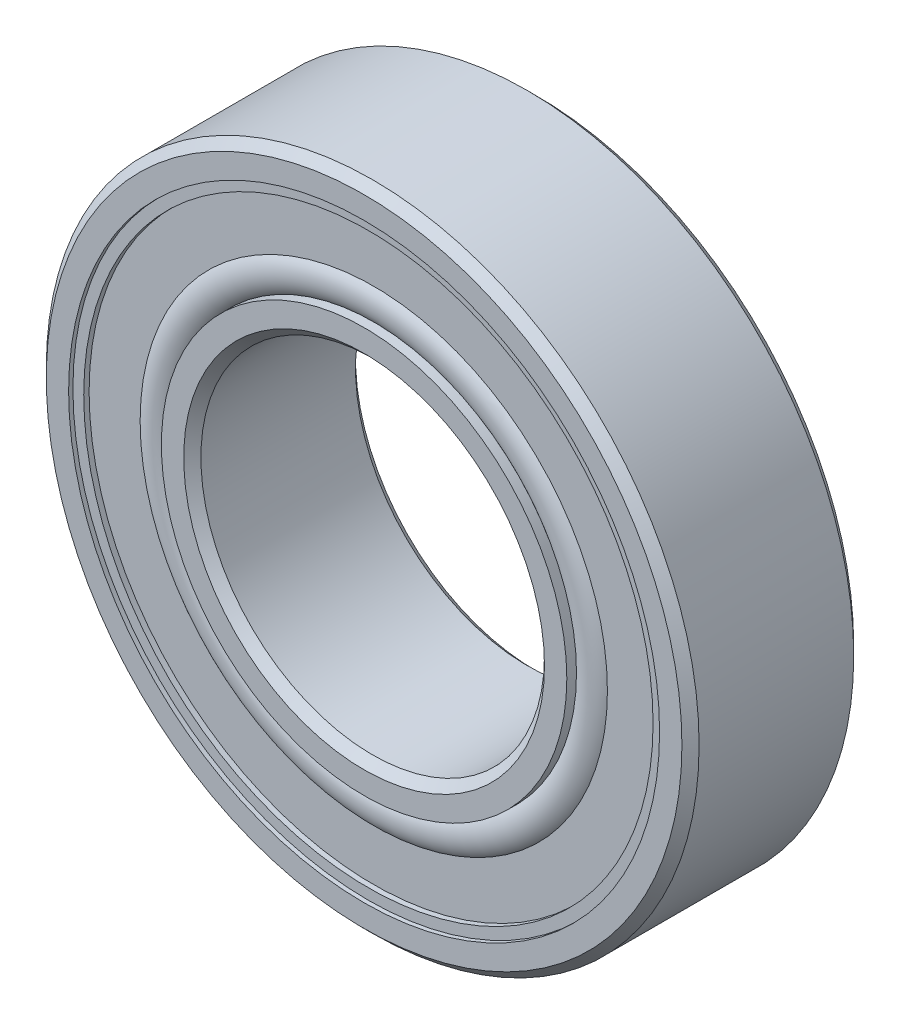
ISO-10303-21;
HEADER;
FILE_DESCRIPTION(('STEP AP214'),'2;1');
FILE_NAME('part.step','',(''),(''),'','','');
FILE_SCHEMA(('AUTOMOTIVE_DESIGN { 1 0 10303 214 1 1 1 1 }'));
ENDSEC;
DATA;
#1=APPLICATION_CONTEXT('core data for automotive mechanical design processes');
#2=APPLICATION_PROTOCOL_DEFINITION('international standard','automotive_design',2000,#1);
#3=PRODUCT_CONTEXT('',#1,'mechanical');
#4=PRODUCT('Part','Part','',(#3));
#5=PRODUCT_RELATED_PRODUCT_CATEGORY('part','',(#4));
#6=PRODUCT_DEFINITION_FORMATION('','',#4);
#7=PRODUCT_DEFINITION_CONTEXT('part definition',#1,'design');
#8=PRODUCT_DEFINITION('design','',#6,#7);
#9=PRODUCT_DEFINITION_SHAPE('','',#8);
#10=(LENGTH_UNIT() NAMED_UNIT(*) SI_UNIT(.MILLI.,.METRE.));
#11=(NAMED_UNIT(*) PLANE_ANGLE_UNIT() SI_UNIT($,.RADIAN.));
#12=(NAMED_UNIT(*) SI_UNIT($,.STERADIAN.) SOLID_ANGLE_UNIT());
#13=UNCERTAINTY_MEASURE_WITH_UNIT(LENGTH_MEASURE(1.E-05),#10,'distance_accuracy_value','');
#14=(GEOMETRIC_REPRESENTATION_CONTEXT(3) GLOBAL_UNCERTAINTY_ASSIGNED_CONTEXT((#13)) GLOBAL_UNIT_ASSIGNED_CONTEXT((#10,
#11,#12)) REPRESENTATION_CONTEXT('',''));
#15=CARTESIAN_POINT('',(0.,0.,0.));
#16=DIRECTION('',(0.,0.,1.));
#17=DIRECTION('',(1.,0.,0.));
#18=AXIS2_PLACEMENT_3D('',#15,#16,#17);
#19=CARTESIAN_POINT('',(0.,0.,-1.65028677787898));
#20=DIRECTION('',(0.,0.,1.));
#21=DIRECTION('',(1.,0.,0.));
#22=AXIS2_PLACEMENT_3D('',#19,#20,#21);
#23=TOROIDAL_SURFACE('',#22,6.35000000000001,0.724713222121017);
#24=CARTESIAN_POINT('',(0.,0.,-2.21836182073602));
#25=DIRECTION('',(0.,0.,1.));
#26=DIRECTION('',(1.,0.,0.));
#27=AXIS2_PLACEMENT_3D('',#24,#25,#26);
#28=CIRCLE('',#27,6.80000000000001);
#29=CARTESIAN_POINT('',(6.80000000000001,0.,-2.21836182073602));
#30=VERTEX_POINT('',#29);
#31=EDGE_CURVE('E11',#30,#30,#28,.T.);
#32=ORIENTED_EDGE('',*,*,#31,.F.);
#33=EDGE_LOOP('',(#32));
#34=FACE_BOUND('',#33,.T.);
#35=CARTESIAN_POINT('',(0.,0.,-2.21836182073602));
#36=DIRECTION('',(0.,0.,1.));
#37=DIRECTION('',(1.,0.,0.));
#38=AXIS2_PLACEMENT_3D('',#35,#36,#37);
#39=CIRCLE('',#38,5.90000000000001);
#40=CARTESIAN_POINT('',(5.90000000000001,0.,-2.21836182073602));
#41=VERTEX_POINT('',#40);
#42=EDGE_CURVE('E73',#41,#41,#39,.T.);
#43=ORIENTED_EDGE('',*,*,#42,.T.);
#44=EDGE_LOOP('',(#43));
#45=FACE_BOUND('',#44,.T.);
#46=ADVANCED_FACE('F48',(#34,#45),#23,.T.);
#47=CARTESIAN_POINT('',(0.,8.28499999999999,-2.21836182073602));
#48=DIRECTION('',(0.,0.,1.));
#49=DIRECTION('',(1.,0.,0.));
#50=AXIS2_PLACEMENT_3D('',#47,#48,#49);
#51=PLANE('',#50);
#52=CARTESIAN_POINT('',(0.,0.,-2.21836182073602));
#53=DIRECTION('',(0.,0.,1.));
#54=DIRECTION('',(1.,0.,0.));
#55=AXIS2_PLACEMENT_3D('',#52,#53,#54);
#56=CIRCLE('',#55,8.28499999999999);
#57=CARTESIAN_POINT('',(8.28499999999999,0.,-2.21836182073602));
#58=VERTEX_POINT('',#57);
#59=EDGE_CURVE('E54',#58,#58,#56,.T.);
#60=ORIENTED_EDGE('',*,*,#59,.F.);
#61=EDGE_LOOP('',(#60));
#62=FACE_BOUND('',#61,.T.);
#63=ORIENTED_EDGE('',*,*,#31,.T.);
#64=EDGE_LOOP('',(#63));
#65=FACE_BOUND('',#64,.T.);
#66=ADVANCED_FACE('F104',(#62,#65),#51,.F.);
#67=CARTESIAN_POINT('',(0.,0.,2.5));
#68=DIRECTION('',(0.,0.,1.));
#69=DIRECTION('',(1.,0.,0.));
#70=AXIS2_PLACEMENT_3D('',#67,#68,#69);
#71=CYLINDRICAL_SURFACE('',#70,8.28499999999999);
#72=CARTESIAN_POINT('',(0.,0.,-2.375));
#73=DIRECTION('',(0.,0.,1.));
#74=DIRECTION('',(1.,0.,0.));
#75=AXIS2_PLACEMENT_3D('',#72,#73,#74);
#76=CIRCLE('',#75,8.28499999999999);
#77=CARTESIAN_POINT('',(8.28499999999999,0.,-2.375));
#78=VERTEX_POINT('',#77);
#79=EDGE_CURVE('E58',#78,#78,#76,.T.);
#80=ORIENTED_EDGE('',*,*,#79,.F.);
#81=EDGE_LOOP('',(#80));
#82=FACE_BOUND('',#81,.T.);
#83=ORIENTED_EDGE('',*,*,#59,.T.);
#84=EDGE_LOOP('',(#83));
#85=FACE_BOUND('',#84,.T.);
#86=ADVANCED_FACE('F99',(#82,#85),#71,.F.);
#87=CARTESIAN_POINT('',(0.,8.59999999999999,-2.375));
#88=DIRECTION('',(0.,0.,1.));
#89=DIRECTION('',(1.,0.,0.));
#90=AXIS2_PLACEMENT_3D('',#87,#88,#89);
#91=PLANE('',#90);
#92=CARTESIAN_POINT('',(0.,0.,-2.375));
#93=DIRECTION('',(0.,0.,1.));
#94=DIRECTION('',(1.,0.,0.));
#95=AXIS2_PLACEMENT_3D('',#92,#93,#94);
#96=CIRCLE('',#95,8.59999999999999);
#97=CARTESIAN_POINT('',(8.59999999999999,0.,-2.375));
#98=VERTEX_POINT('',#97);
#99=EDGE_CURVE('E62',#98,#98,#96,.T.);
#100=ORIENTED_EDGE('',*,*,#99,.F.);
#101=EDGE_LOOP('',(#100));
#102=FACE_BOUND('',#101,.T.);
#103=ORIENTED_EDGE('',*,*,#79,.T.);
#104=EDGE_LOOP('',(#103));
#105=FACE_BOUND('',#104,.T.);
#106=ADVANCED_FACE('F93',(#102,#105),#91,.F.);
#107=CARTESIAN_POINT('',(0.,0.,2.5));
#108=DIRECTION('',(0.,0.,1.));
#109=DIRECTION('',(1.,0.,0.));
#110=AXIS2_PLACEMENT_3D('',#107,#108,#109);
#111=CYLINDRICAL_SURFACE('',#110,8.59999999999999);
#112=CARTESIAN_POINT('',(0.,0.,-1.74844728294409));
#113=DIRECTION('',(0.,0.,1.));
#114=DIRECTION('',(1.,0.,0.));
#115=AXIS2_PLACEMENT_3D('',#112,#113,#114);
#116=CIRCLE('',#115,8.59999999999999);
#117=CARTESIAN_POINT('',(8.59999999999999,0.,-1.74844728294409));
#118=VERTEX_POINT('',#117);
#119=EDGE_CURVE('E67',#118,#118,#116,.T.);
#120=ORIENTED_EDGE('',*,*,#119,.F.);
#121=EDGE_LOOP('',(#120));
#122=FACE_BOUND('',#121,.T.);
#123=ORIENTED_EDGE('',*,*,#99,.T.);
#124=EDGE_LOOP('',(#123));
#125=FACE_BOUND('',#124,.T.);
#126=ADVANCED_FACE('F87',(#122,#125),#111,.T.);
#127=CARTESIAN_POINT('',(0.,8.59999999999999,-1.74844728294409));
#128=DIRECTION('',(0.,0.,-1.));
#129=DIRECTION('',(-1.,0.,0.));
#130=AXIS2_PLACEMENT_3D('',#127,#128,#129);
#131=PLANE('',#130);
#132=CARTESIAN_POINT('',(0.,0.,-1.74844728294409));
#133=DIRECTION('',(0.,0.,1.));
#134=DIRECTION('',(1.,0.,0.));
#135=AXIS2_PLACEMENT_3D('',#132,#133,#134);
#136=CIRCLE('',#135,5.90000000000001);
#137=CARTESIAN_POINT('',(5.90000000000001,0.,-1.74844728294409));
#138=VERTEX_POINT('',#137);
#139=EDGE_CURVE('E70',#138,#138,#136,.T.);
#140=ORIENTED_EDGE('',*,*,#139,.F.);
#141=EDGE_LOOP('',(#140));
#142=FACE_BOUND('',#141,.T.);
#143=ORIENTED_EDGE('',*,*,#119,.T.);
#144=EDGE_LOOP('',(#143));
#145=FACE_BOUND('',#144,.T.);
#146=ADVANCED_FACE('F81',(#142,#145),#131,.F.);
#147=CARTESIAN_POINT('',(0.,0.,2.5));
#148=DIRECTION('',(0.,0.,1.));
#149=DIRECTION('',(1.,0.,0.));
#150=AXIS2_PLACEMENT_3D('',#147,#148,#149);
#151=CYLINDRICAL_SURFACE('',#150,5.90000000000001);
#152=ORIENTED_EDGE('',*,*,#42,.F.);
#153=EDGE_LOOP('',(#152));
#154=FACE_BOUND('',#153,.T.);
#155=ORIENTED_EDGE('',*,*,#139,.T.);
#156=EDGE_LOOP('',(#155));
#157=FACE_BOUND('',#156,.T.);
#158=ADVANCED_FACE('F78',(#154,#157),#151,.F.);
#159=CLOSED_SHELL('',(#46,#66,#86,#106,#126,#146,#158));
#160=MANIFOLD_SOLID_BREP('B2',#159);
#161=CARTESIAN_POINT('',(0.,8.59999999999999,2.375));
#162=DIRECTION('',(0.,0.,-1.));
#163=DIRECTION('',(-1.,0.,0.));
#164=AXIS2_PLACEMENT_3D('',#161,#162,#163);
#165=PLANE('',#164);
#166=CARTESIAN_POINT('',(0.,0.,2.375));
#167=DIRECTION('',(0.,0.,1.));
#168=DIRECTION('',(1.,0.,0.));
#169=AXIS2_PLACEMENT_3D('',#166,#167,#168);
#170=CIRCLE('',#169,8.28499999999999);
#171=CARTESIAN_POINT('',(8.28499999999999,0.,2.375));
#172=VERTEX_POINT('',#171);
#173=EDGE_CURVE('E172',#172,#172,#170,.T.);
#174=ORIENTED_EDGE('',*,*,#173,.F.);
#175=EDGE_LOOP('',(#174));
#176=FACE_BOUND('',#175,.T.);
#177=CARTESIAN_POINT('',(0.,0.,2.375));
#178=DIRECTION('',(0.,0.,1.));
#179=DIRECTION('',(1.,0.,0.));
#180=AXIS2_PLACEMENT_3D('',#177,#178,#179);
#181=CIRCLE('',#180,8.59999999999999);
#182=CARTESIAN_POINT('',(8.59999999999999,0.,2.375));
#183=VERTEX_POINT('',#182);
#184=EDGE_CURVE('E47',#183,#183,#181,.T.);
#185=ORIENTED_EDGE('',*,*,#184,.T.);
#186=EDGE_LOOP('',(#185));
#187=FACE_BOUND('',#186,.T.);
#188=ADVANCED_FACE('F147',(#176,#187),#165,.F.);
#189=CARTESIAN_POINT('',(0.,0.,2.5));
#190=DIRECTION('',(0.,0.,1.));
#191=DIRECTION('',(1.,0.,0.));
#192=AXIS2_PLACEMENT_3D('',#189,#190,#191);
#193=CYLINDRICAL_SURFACE('',#192,8.59999999999999);
#194=ORIENTED_EDGE('',*,*,#184,.F.);
#195=EDGE_LOOP('',(#194));
#196=FACE_BOUND('',#195,.T.);
#197=CARTESIAN_POINT('',(0.,0.,1.74844728294409));
#198=DIRECTION('',(0.,0.,1.));
#199=DIRECTION('',(1.,0.,0.));
#200=AXIS2_PLACEMENT_3D('',#197,#198,#199);
#201=CIRCLE('',#200,8.59999999999999);
#202=CARTESIAN_POINT('',(8.59999999999999,0.,1.74844728294409));
#203=VERTEX_POINT('',#202);
#204=EDGE_CURVE('E153',#203,#203,#201,.T.);
#205=ORIENTED_EDGE('',*,*,#204,.T.);
#206=EDGE_LOOP('',(#205));
#207=FACE_BOUND('',#206,.T.);
#208=ADVANCED_FACE('F179',(#196,#207),#193,.T.);
#209=CARTESIAN_POINT('',(0.,8.59999999999999,1.74844728294409));
#210=DIRECTION('',(0.,0.,1.));
#211=DIRECTION('',(1.,0.,0.));
#212=AXIS2_PLACEMENT_3D('',#209,#210,#211);
#213=PLANE('',#212);
#214=ORIENTED_EDGE('',*,*,#204,.F.);
#215=EDGE_LOOP('',(#214));
#216=FACE_BOUND('',#215,.T.);
#217=CARTESIAN_POINT('',(0.,0.,1.74844728294409));
#218=DIRECTION('',(0.,0.,1.));
#219=DIRECTION('',(1.,0.,0.));
#220=AXIS2_PLACEMENT_3D('',#217,#218,#219);
#221=CIRCLE('',#220,5.90000000000001);
#222=CARTESIAN_POINT('',(5.90000000000001,0.,1.74844728294409));
#223=VERTEX_POINT('',#222);
#224=EDGE_CURVE('E157',#223,#223,#221,.T.);
#225=ORIENTED_EDGE('',*,*,#224,.T.);
#226=EDGE_LOOP('',(#225));
#227=FACE_BOUND('',#226,.T.);
#228=ADVANCED_FACE('F183',(#216,#227),#213,.F.);
#229=CARTESIAN_POINT('',(0.,0.,2.5));
#230=DIRECTION('',(0.,0.,1.));
#231=DIRECTION('',(1.,0.,0.));
#232=AXIS2_PLACEMENT_3D('',#229,#230,#231);
#233=CYLINDRICAL_SURFACE('',#232,5.90000000000001);
#234=ORIENTED_EDGE('',*,*,#224,.F.);
#235=EDGE_LOOP('',(#234));
#236=FACE_BOUND('',#235,.T.);
#237=CARTESIAN_POINT('',(0.,0.,2.21836182073602));
#238=DIRECTION('',(0.,0.,1.));
#239=DIRECTION('',(1.,0.,0.));
#240=AXIS2_PLACEMENT_3D('',#237,#238,#239);
#241=CIRCLE('',#240,5.90000000000001);
#242=CARTESIAN_POINT('',(5.90000000000001,0.,2.21836182073602));
#243=VERTEX_POINT('',#242);
#244=EDGE_CURVE('E161',#243,#243,#241,.T.);
#245=ORIENTED_EDGE('',*,*,#244,.T.);
#246=EDGE_LOOP('',(#245));
#247=FACE_BOUND('',#246,.T.);
#248=ADVANCED_FACE('F188',(#236,#247),#233,.F.);
#249=CARTESIAN_POINT('',(0.,0.,1.65028677787898));
#250=DIRECTION('',(0.,0.,1.));
#251=DIRECTION('',(1.,0.,0.));
#252=AXIS2_PLACEMENT_3D('',#249,#250,#251);
#253=TOROIDAL_SURFACE('',#252,6.35000000000001,0.724713222121017);
#254=ORIENTED_EDGE('',*,*,#244,.F.);
#255=EDGE_LOOP('',(#254));
#256=FACE_BOUND('',#255,.T.);
#257=CARTESIAN_POINT('',(0.,0.,2.21836182073602));
#258=DIRECTION('',(0.,0.,1.));
#259=DIRECTION('',(1.,0.,0.));
#260=AXIS2_PLACEMENT_3D('',#257,#258,#259);
#261=CIRCLE('',#260,6.80000000000001);
#262=CARTESIAN_POINT('',(6.80000000000001,0.,2.21836182073602));
#263=VERTEX_POINT('',#262);
#264=EDGE_CURVE('E166',#263,#263,#261,.T.);
#265=ORIENTED_EDGE('',*,*,#264,.T.);
#266=EDGE_LOOP('',(#265));
#267=FACE_BOUND('',#266,.T.);
#268=ADVANCED_FACE('F194',(#256,#267),#253,.T.);
#269=CARTESIAN_POINT('',(0.,8.28499999999999,2.21836182073602));
#270=DIRECTION('',(0.,0.,-1.));
#271=DIRECTION('',(-1.,0.,0.));
#272=AXIS2_PLACEMENT_3D('',#269,#270,#271);
#273=PLANE('',#272);
#274=ORIENTED_EDGE('',*,*,#264,.F.);
#275=EDGE_LOOP('',(#274));
#276=FACE_BOUND('',#275,.T.);
#277=CARTESIAN_POINT('',(0.,0.,2.21836182073602));
#278=DIRECTION('',(0.,0.,1.));
#279=DIRECTION('',(1.,0.,0.));
#280=AXIS2_PLACEMENT_3D('',#277,#278,#279);
#281=CIRCLE('',#280,8.28499999999999);
#282=CARTESIAN_POINT('',(8.28499999999999,0.,2.21836182073602));
#283=VERTEX_POINT('',#282);
#284=EDGE_CURVE('E169',#283,#283,#281,.T.);
#285=ORIENTED_EDGE('',*,*,#284,.T.);
#286=EDGE_LOOP('',(#285));
#287=FACE_BOUND('',#286,.T.);
#288=ADVANCED_FACE('F198',(#276,#287),#273,.F.);
#289=CARTESIAN_POINT('',(0.,0.,2.5));
#290=DIRECTION('',(0.,0.,1.));
#291=DIRECTION('',(1.,0.,0.));
#292=AXIS2_PLACEMENT_3D('',#289,#290,#291);
#293=CYLINDRICAL_SURFACE('',#292,8.28499999999999);
#294=ORIENTED_EDGE('',*,*,#284,.F.);
#295=EDGE_LOOP('',(#294));
#296=FACE_BOUND('',#295,.T.);
#297=ORIENTED_EDGE('',*,*,#173,.T.);
#298=EDGE_LOOP('',(#297));
#299=FACE_BOUND('',#298,.T.);
#300=ADVANCED_FACE('F176',(#296,#299),#293,.F.);
#301=CLOSED_SHELL('',(#188,#208,#228,#248,#268,#288,#300));
#302=MANIFOLD_SOLID_BREP('B6',#301);
#303=CARTESIAN_POINT('',(-4.66021017022734,5.55382221261265,0.));
#304=DIRECTION('',(0.,0.,1.));
#305=DIRECTION('',(-0.64278760968653,0.766044443118986,0.));
#306=AXIS2_PLACEMENT_3D('',#303,#304,#305);
#307=SPHERICAL_SURFACE('',#306,1.74844728294409);
#308=CARTESIAN_POINT('',(-4.66021017022734,5.55382221261265,1.74844728294409));
#309=VERTEX_POINT('',#308);
#310=VERTEX_LOOP('',#309);
#311=FACE_BOUND('',#310,.T.);
#312=ADVANCED_FACE('F246',(#311),#307,.T.);
#313=CLOSED_SHELL('',(#312));
#314=MANIFOLD_SOLID_BREP('B42',#313);
#315=CARTESIAN_POINT('',(-7.13985620933849,1.25894928808532,0.));
#316=DIRECTION('',(0.,0.,1.));
#317=DIRECTION('',(-0.984807753012206,0.17364817766694,0.));
#318=AXIS2_PLACEMENT_3D('',#315,#316,#317);
#319=SPHERICAL_SURFACE('',#318,1.74844728294409);
#320=CARTESIAN_POINT('',(-7.13985620933849,1.25894928808532,1.74844728294409));
#321=VERTEX_POINT('',#320);
#322=VERTEX_LOOP('',#321);
#323=FACE_BOUND('',#322,.T.);
#324=ADVANCED_FACE('F265',(#323),#319,.T.);
#325=CLOSED_SHELL('',(#324));
#326=MANIFOLD_SOLID_BREP('B143',#325);
#327=CARTESIAN_POINT('',(-6.27868417743721,-3.62499999999994,0.));
#328=DIRECTION('',(0.,0.,1.));
#329=DIRECTION('',(-0.866025403784443,-0.499999999999992,0.));
#330=AXIS2_PLACEMENT_3D('',#327,#328,#329);
#331=SPHERICAL_SURFACE('',#330,1.74844728294409);
#332=CARTESIAN_POINT('',(-6.27868417743721,-3.62499999999994,1.74844728294409));
#333=VERTEX_POINT('',#332);
#334=VERTEX_LOOP('',#333);
#335=FACE_BOUND('',#334,.T.);
#336=ADVANCED_FACE('F284',(#335),#331,.T.);
#337=CLOSED_SHELL('',(#336));
#338=MANIFOLD_SOLID_BREP('B242',#337);
#339=CARTESIAN_POINT('',(-2.47964603911115,-6.81277150069782,0.));
#340=DIRECTION('',(0.,0.,1.));
#341=DIRECTION('',(-0.342020143325676,-0.939692620785906,0.));
#342=AXIS2_PLACEMENT_3D('',#339,#340,#341);
#343=SPHERICAL_SURFACE('',#342,1.74844728294409);
#344=CARTESIAN_POINT('',(-2.47964603911115,-6.81277150069782,1.74844728294409));
#345=VERTEX_POINT('',#344);
#346=VERTEX_LOOP('',#345);
#347=FACE_BOUND('',#346,.T.);
#348=ADVANCED_FACE('F303',(#347),#343,.T.);
#349=CLOSED_SHELL('',(#348));
#350=MANIFOLD_SOLID_BREP('B261',#349);
#351=CARTESIAN_POINT('',(2.47964603911106,-6.81277150069785,0.));
#352=DIRECTION('',(0.,0.,1.));
#353=DIRECTION('',(0.342020143325663,-0.939692620785911,0.));
#354=AXIS2_PLACEMENT_3D('',#351,#352,#353);
#355=SPHERICAL_SURFACE('',#354,1.74844728294409);
#356=CARTESIAN_POINT('',(2.47964603911106,-6.81277150069785,1.74844728294409));
#357=VERTEX_POINT('',#356);
#358=VERTEX_LOOP('',#357);
#359=FACE_BOUND('',#358,.T.);
#360=ADVANCED_FACE('F322',(#359),#355,.T.);
#361=CLOSED_SHELL('',(#360));
#362=MANIFOLD_SOLID_BREP('B280',#361);
#363=CARTESIAN_POINT('',(6.27868417743716,-3.62500000000003,0.));
#364=DIRECTION('',(0.,0.,1.));
#365=DIRECTION('',(0.866025403784436,-0.500000000000004,0.));
#366=AXIS2_PLACEMENT_3D('',#363,#364,#365);
#367=SPHERICAL_SURFACE('',#366,1.74844728294409);
#368=CARTESIAN_POINT('',(6.27868417743716,-3.62500000000003,1.74844728294409));
#369=VERTEX_POINT('',#368);
#370=VERTEX_LOOP('',#369);
#371=FACE_BOUND('',#370,.T.);
#372=ADVANCED_FACE('F341',(#371),#367,.T.);
#373=CLOSED_SHELL('',(#372));
#374=MANIFOLD_SOLID_BREP('B299',#373);
#375=CARTESIAN_POINT('',(7.13985620933851,1.25894928808522,0.));
#376=DIRECTION('',(0.,0.,1.));
#377=DIRECTION('',(0.984807753012209,0.173648177666927,0.));
#378=AXIS2_PLACEMENT_3D('',#375,#376,#377);
#379=SPHERICAL_SURFACE('',#378,1.74844728294409);
#380=CARTESIAN_POINT('',(7.13985620933851,1.25894928808522,1.74844728294409));
#381=VERTEX_POINT('',#380);
#382=VERTEX_LOOP('',#381);
#383=FACE_BOUND('',#382,.T.);
#384=ADVANCED_FACE('F360',(#383),#379,.T.);
#385=CLOSED_SHELL('',(#384));
#386=MANIFOLD_SOLID_BREP('B318',#385);
#387=CARTESIAN_POINT('',(4.66021017022742,5.55382221261258,0.));
#388=DIRECTION('',(0.,0.,1.));
#389=DIRECTION('',(0.642787609686541,0.766044443118977,0.));
#390=AXIS2_PLACEMENT_3D('',#387,#388,#389);
#391=SPHERICAL_SURFACE('',#390,1.74844728294409);
#392=CARTESIAN_POINT('',(4.66021017022742,5.55382221261258,1.74844728294409));
#393=VERTEX_POINT('',#392);
#394=VERTEX_LOOP('',#393);
#395=FACE_BOUND('',#394,.T.);
#396=ADVANCED_FACE('F379',(#395),#391,.T.);
#397=CLOSED_SHELL('',(#396));
#398=MANIFOLD_SOLID_BREP('B337',#397);
#399=CARTESIAN_POINT('',(0.,7.25,0.));
#400=DIRECTION('',(0.,0.,1.));
#401=DIRECTION('',(0.,1.,0.));
#402=AXIS2_PLACEMENT_3D('',#399,#400,#401);
#403=SPHERICAL_SURFACE('',#402,1.74844728294409);
#404=CARTESIAN_POINT('',(0.,7.25,1.74844728294409));
#405=VERTEX_POINT('',#404);
#406=VERTEX_LOOP('',#405);
#407=FACE_BOUND('',#406,.T.);
#408=ADVANCED_FACE('F400',(#407),#403,.T.);
#409=CLOSED_SHELL('',(#408));
#410=MANIFOLD_SOLID_BREP('B356',#409);
#411=CARTESIAN_POINT('',(0.,0.,2.5));
#412=DIRECTION('',(0.,0.,1.));
#413=DIRECTION('',(1.,0.,0.));
#414=AXIS2_PLACEMENT_3D('',#411,#412,#413);
#415=CONICAL_SURFACE('',#414,5.25,0.785398163397443);
#416=CARTESIAN_POINT('',(0.,0.,2.25));
#417=DIRECTION('',(0.,0.,1.));
#418=DIRECTION('',(1.,0.,0.));
#419=AXIS2_PLACEMENT_3D('',#416,#417,#418);
#420=CIRCLE('',#419,5.);
#421=CARTESIAN_POINT('',(5.,0.,2.25));
#422=VERTEX_POINT('',#421);
#423=EDGE_CURVE('E399',#422,#422,#420,.T.);
#424=ORIENTED_EDGE('',*,*,#423,.F.);
#425=EDGE_LOOP('',(#424));
#426=FACE_BOUND('',#425,.T.);
#427=CARTESIAN_POINT('',(0.,0.,2.5));
#428=DIRECTION('',(0.,0.,1.));
#429=DIRECTION('',(1.,0.,0.));
#430=AXIS2_PLACEMENT_3D('',#427,#428,#429);
#431=CIRCLE('',#430,5.25);
#432=CARTESIAN_POINT('',(5.25,0.,2.5));
#433=VERTEX_POINT('',#432);
#434=EDGE_CURVE('E446',#433,#433,#431,.T.);
#435=ORIENTED_EDGE('',*,*,#434,.T.);
#436=EDGE_LOOP('',(#435));
#437=FACE_BOUND('',#436,.T.);
#438=ADVANCED_FACE('F418',(#426,#437),#415,.F.);
#439=CARTESIAN_POINT('',(0.,0.,2.5));
#440=DIRECTION('',(0.,0.,1.));
#441=DIRECTION('',(1.,0.,0.));
#442=AXIS2_PLACEMENT_3D('',#439,#440,#441);
#443=CYLINDRICAL_SURFACE('',#442,5.);
#444=CARTESIAN_POINT('',(0.,0.,-2.25));
#445=DIRECTION('',(0.,0.,1.));
#446=DIRECTION('',(1.,0.,0.));
#447=AXIS2_PLACEMENT_3D('',#444,#445,#446);
#448=CIRCLE('',#447,5.);
#449=CARTESIAN_POINT('',(5.,0.,-2.25));
#450=VERTEX_POINT('',#449);
#451=EDGE_CURVE('E424',#450,#450,#448,.T.);
#452=ORIENTED_EDGE('',*,*,#451,.F.);
#453=EDGE_LOOP('',(#452));
#454=FACE_BOUND('',#453,.T.);
#455=ORIENTED_EDGE('',*,*,#423,.T.);
#456=EDGE_LOOP('',(#455));
#457=FACE_BOUND('',#456,.T.);
#458=ADVANCED_FACE('F483',(#454,#457),#443,.F.);
#459=CARTESIAN_POINT('',(0.,0.,-2.25));
#460=DIRECTION('',(0.,0.,-1.));
#461=DIRECTION('',(-1.,0.,0.));
#462=AXIS2_PLACEMENT_3D('',#459,#460,#461);
#463=CONICAL_SURFACE('',#462,5.,0.785398163397438);
#464=CARTESIAN_POINT('',(0.,0.,-2.5));
#465=DIRECTION('',(0.,0.,1.));
#466=DIRECTION('',(1.,0.,0.));
#467=AXIS2_PLACEMENT_3D('',#464,#465,#466);
#468=CIRCLE('',#467,5.25);
#469=CARTESIAN_POINT('',(5.25,0.,-2.5));
#470=VERTEX_POINT('',#469);
#471=EDGE_CURVE('E428',#470,#470,#468,.T.);
#472=ORIENTED_EDGE('',*,*,#471,.F.);
#473=EDGE_LOOP('',(#472));
#474=FACE_BOUND('',#473,.T.);
#475=ORIENTED_EDGE('',*,*,#451,.T.);
#476=EDGE_LOOP('',(#475));
#477=FACE_BOUND('',#476,.T.);
#478=ADVANCED_FACE('F478',(#474,#477),#463,.F.);
#479=CARTESIAN_POINT('',(0.,5.25,-2.5));
#480=DIRECTION('',(0.,0.,1.));
#481=DIRECTION('',(1.,0.,0.));
#482=AXIS2_PLACEMENT_3D('',#479,#480,#481);
#483=PLANE('',#482);
#484=CARTESIAN_POINT('',(0.,0.,-2.5));
#485=DIRECTION('',(0.,0.,1.));
#486=DIRECTION('',(1.,0.,0.));
#487=AXIS2_PLACEMENT_3D('',#484,#485,#486);
#488=CIRCLE('',#487,5.90000000000001);
#489=CARTESIAN_POINT('',(5.90000000000001,0.,-2.5));
#490=VERTEX_POINT('',#489);
#491=EDGE_CURVE('E432',#490,#490,#488,.T.);
#492=ORIENTED_EDGE('',*,*,#491,.F.);
#493=EDGE_LOOP('',(#492));
#494=FACE_BOUND('',#493,.T.);
#495=ORIENTED_EDGE('',*,*,#471,.T.);
#496=EDGE_LOOP('',(#495));
#497=FACE_BOUND('',#496,.T.);
#498=ADVANCED_FACE('F472',(#494,#497),#483,.F.);
#499=CARTESIAN_POINT('',(0.,0.,2.5));
#500=DIRECTION('',(0.,0.,1.));
#501=DIRECTION('',(1.,0.,0.));
#502=AXIS2_PLACEMENT_3D('',#499,#500,#501);
#503=CYLINDRICAL_SURFACE('',#502,5.9);
#504=CARTESIAN_POINT('',(0.,0.,-1.11111111111111));
#505=DIRECTION('',(0.,0.,1.));
#506=DIRECTION('',(1.,0.,0.));
#507=AXIS2_PLACEMENT_3D('',#504,#505,#506);
#508=CIRCLE('',#507,5.9);
#509=CARTESIAN_POINT('',(5.9,0.,-1.11111111111111));
#510=VERTEX_POINT('',#509);
#511=EDGE_CURVE('E437',#510,#510,#508,.T.);
#512=ORIENTED_EDGE('',*,*,#511,.F.);
#513=EDGE_LOOP('',(#512));
#514=FACE_BOUND('',#513,.T.);
#515=ORIENTED_EDGE('',*,*,#491,.T.);
#516=EDGE_LOOP('',(#515));
#517=FACE_BOUND('',#516,.T.);
#518=ADVANCED_FACE('F466',(#514,#517),#503,.T.);
#519=CARTESIAN_POINT('',(0.,0.,0.));
#520=DIRECTION('',(0.,0.,1.));
#521=DIRECTION('',(1.,0.,0.));
#522=AXIS2_PLACEMENT_3D('',#519,#520,#521);
#523=TOROIDAL_SURFACE('',#522,7.25,1.74844728294409);
#524=CARTESIAN_POINT('',(0.,0.,1.11111111111111));
#525=DIRECTION('',(0.,0.,1.));
#526=DIRECTION('',(1.,0.,0.));
#527=AXIS2_PLACEMENT_3D('',#524,#525,#526);
#528=CIRCLE('',#527,5.9);
#529=CARTESIAN_POINT('',(5.9,0.,1.11111111111111));
#530=VERTEX_POINT('',#529);
#531=EDGE_CURVE('E440',#530,#530,#528,.T.);
#532=ORIENTED_EDGE('',*,*,#531,.F.);
#533=EDGE_LOOP('',(#532));
#534=FACE_BOUND('',#533,.T.);
#535=ORIENTED_EDGE('',*,*,#511,.T.);
#536=EDGE_LOOP('',(#535));
#537=FACE_BOUND('',#536,.T.);
#538=ADVANCED_FACE('F460',(#534,#537),#523,.F.);
#539=CARTESIAN_POINT('',(0.,0.,2.5));
#540=DIRECTION('',(0.,0.,1.));
#541=DIRECTION('',(1.,0.,0.));
#542=AXIS2_PLACEMENT_3D('',#539,#540,#541);
#543=CYLINDRICAL_SURFACE('',#542,5.9);
#544=CARTESIAN_POINT('',(0.,0.,2.5));
#545=DIRECTION('',(0.,0.,1.));
#546=DIRECTION('',(1.,0.,0.));
#547=AXIS2_PLACEMENT_3D('',#544,#545,#546);
#548=CIRCLE('',#547,5.90000000000001);
#549=CARTESIAN_POINT('',(5.90000000000001,0.,2.5));
#550=VERTEX_POINT('',#549);
#551=EDGE_CURVE('E443',#550,#550,#548,.T.);
#552=ORIENTED_EDGE('',*,*,#551,.F.);
#553=EDGE_LOOP('',(#552));
#554=FACE_BOUND('',#553,.T.);
#555=ORIENTED_EDGE('',*,*,#531,.T.);
#556=EDGE_LOOP('',(#555));
#557=FACE_BOUND('',#556,.T.);
#558=ADVANCED_FACE('F454',(#554,#557),#543,.T.);
#559=CARTESIAN_POINT('',(0.,5.25,2.5));
#560=DIRECTION('',(0.,0.,-1.));
#561=DIRECTION('',(-1.,0.,0.));
#562=AXIS2_PLACEMENT_3D('',#559,#560,#561);
#563=PLANE('',#562);
#564=ORIENTED_EDGE('',*,*,#434,.F.);
#565=EDGE_LOOP('',(#564));
#566=FACE_BOUND('',#565,.T.);
#567=ORIENTED_EDGE('',*,*,#551,.T.);
#568=EDGE_LOOP('',(#567));
#569=FACE_BOUND('',#568,.T.);
#570=ADVANCED_FACE('F451',(#566,#569),#563,.F.);
#571=CLOSED_SHELL('',(#438,#458,#478,#498,#518,#538,#558,#570));
#572=MANIFOLD_SOLID_BREP('B375',#571);
#573=CARTESIAN_POINT('',(0.,0.,2.25));
#574=DIRECTION('',(0.,0.,-1.));
#575=DIRECTION('',(-1.,0.,0.));
#576=AXIS2_PLACEMENT_3D('',#573,#574,#575);
#577=CONICAL_SURFACE('',#576,9.50000000000001,0.785398163397451);
#578=CARTESIAN_POINT('',(0.,0.,2.5));
#579=DIRECTION('',(0.,0.,1.));
#580=DIRECTION('',(1.,0.,0.));
#581=AXIS2_PLACEMENT_3D('',#578,#579,#580);
#582=CIRCLE('',#581,9.25);
#583=CARTESIAN_POINT('',(9.25,0.,2.5));
#584=VERTEX_POINT('',#583);
#585=EDGE_CURVE('E417',#584,#584,#582,.T.);
#586=ORIENTED_EDGE('',*,*,#585,.F.);
#587=EDGE_LOOP('',(#586));
#588=FACE_BOUND('',#587,.T.);
#589=CARTESIAN_POINT('',(0.,0.,2.25));
#590=DIRECTION('',(0.,0.,1.));
#591=DIRECTION('',(1.,0.,0.));
#592=AXIS2_PLACEMENT_3D('',#589,#590,#591);
#593=CIRCLE('',#592,9.50000000000001);
#594=CARTESIAN_POINT('',(9.50000000000001,0.,2.25));
#595=VERTEX_POINT('',#594);
#596=EDGE_CURVE('E552',#595,#595,#593,.T.);
#597=ORIENTED_EDGE('',*,*,#596,.T.);
#598=EDGE_LOOP('',(#597));
#599=FACE_BOUND('',#598,.T.);
#600=ADVANCED_FACE('F524',(#588,#599),#577,.T.);
#601=CARTESIAN_POINT('',(0.,9.25,2.5));
#602=DIRECTION('',(0.,0.,-1.));
#603=DIRECTION('',(-1.,0.,0.));
#604=AXIS2_PLACEMENT_3D('',#601,#602,#603);
#605=PLANE('',#604);
#606=CARTESIAN_POINT('',(0.,0.,2.5));
#607=DIRECTION('',(0.,0.,1.));
#608=DIRECTION('',(1.,0.,0.));
#609=AXIS2_PLACEMENT_3D('',#606,#607,#608);
#610=CIRCLE('',#609,8.59999999999999);
#611=CARTESIAN_POINT('',(8.59999999999999,0.,2.5));
#612=VERTEX_POINT('',#611);
#613=EDGE_CURVE('E530',#612,#612,#610,.T.);
#614=ORIENTED_EDGE('',*,*,#613,.F.);
#615=EDGE_LOOP('',(#614));
#616=FACE_BOUND('',#615,.T.);
#617=ORIENTED_EDGE('',*,*,#585,.T.);
#618=EDGE_LOOP('',(#617));
#619=FACE_BOUND('',#618,.T.);
#620=ADVANCED_FACE('F589',(#616,#619),#605,.F.);
#621=CARTESIAN_POINT('',(0.,0.,2.5));
#622=DIRECTION('',(0.,0.,1.));
#623=DIRECTION('',(1.,0.,0.));
#624=AXIS2_PLACEMENT_3D('',#621,#622,#623);
#625=CYLINDRICAL_SURFACE('',#624,8.6);
#626=CARTESIAN_POINT('',(0.,0.,1.11111111111111));
#627=DIRECTION('',(0.,0.,1.));
#628=DIRECTION('',(1.,0.,0.));
#629=AXIS2_PLACEMENT_3D('',#626,#627,#628);
#630=CIRCLE('',#629,8.6);
#631=CARTESIAN_POINT('',(8.6,0.,1.11111111111111));
#632=VERTEX_POINT('',#631);
#633=EDGE_CURVE('E534',#632,#632,#630,.T.);
#634=ORIENTED_EDGE('',*,*,#633,.F.);
#635=EDGE_LOOP('',(#634));
#636=FACE_BOUND('',#635,.T.);
#637=ORIENTED_EDGE('',*,*,#613,.T.);
#638=EDGE_LOOP('',(#637));
#639=FACE_BOUND('',#638,.T.);
#640=ADVANCED_FACE('F584',(#636,#639),#625,.F.);
#641=CARTESIAN_POINT('',(0.,0.,0.));
#642=DIRECTION('',(0.,0.,1.));
#643=DIRECTION('',(1.,0.,0.));
#644=AXIS2_PLACEMENT_3D('',#641,#642,#643);
#645=TOROIDAL_SURFACE('',#644,7.25,1.74844728294409);
#646=CARTESIAN_POINT('',(0.,0.,-1.11111111111111));
#647=DIRECTION('',(0.,0.,1.));
#648=DIRECTION('',(1.,0.,0.));
#649=AXIS2_PLACEMENT_3D('',#646,#647,#648);
#650=CIRCLE('',#649,8.6);
#651=CARTESIAN_POINT('',(8.6,0.,-1.11111111111111));
#652=VERTEX_POINT('',#651);
#653=EDGE_CURVE('E538',#652,#652,#650,.T.);
#654=ORIENTED_EDGE('',*,*,#653,.F.);
#655=EDGE_LOOP('',(#654));
#656=FACE_BOUND('',#655,.T.);
#657=ORIENTED_EDGE('',*,*,#633,.T.);
#658=EDGE_LOOP('',(#657));
#659=FACE_BOUND('',#658,.T.);
#660=ADVANCED_FACE('F578',(#656,#659),#645,.F.);
#661=CARTESIAN_POINT('',(0.,0.,2.5));
#662=DIRECTION('',(0.,0.,1.));
#663=DIRECTION('',(1.,0.,0.));
#664=AXIS2_PLACEMENT_3D('',#661,#662,#663);
#665=CYLINDRICAL_SURFACE('',#664,8.6);
#666=CARTESIAN_POINT('',(0.,0.,-2.5));
#667=DIRECTION('',(0.,0.,1.));
#668=DIRECTION('',(1.,0.,0.));
#669=AXIS2_PLACEMENT_3D('',#666,#667,#668);
#670=CIRCLE('',#669,8.59999999999999);
#671=CARTESIAN_POINT('',(8.59999999999999,0.,-2.5));
#672=VERTEX_POINT('',#671);
#673=EDGE_CURVE('E543',#672,#672,#670,.T.);
#674=ORIENTED_EDGE('',*,*,#673,.F.);
#675=EDGE_LOOP('',(#674));
#676=FACE_BOUND('',#675,.T.);
#677=ORIENTED_EDGE('',*,*,#653,.T.);
#678=EDGE_LOOP('',(#677));
#679=FACE_BOUND('',#678,.T.);
#680=ADVANCED_FACE('F572',(#676,#679),#665,.F.);
#681=CARTESIAN_POINT('',(0.,9.25,-2.5));
#682=DIRECTION('',(0.,0.,1.));
#683=DIRECTION('',(1.,0.,0.));
#684=AXIS2_PLACEMENT_3D('',#681,#682,#683);
#685=PLANE('',#684);
#686=CARTESIAN_POINT('',(0.,0.,-2.5));
#687=DIRECTION('',(0.,0.,1.));
#688=DIRECTION('',(1.,0.,0.));
#689=AXIS2_PLACEMENT_3D('',#686,#687,#688);
#690=CIRCLE('',#689,9.25);
#691=CARTESIAN_POINT('',(9.25,0.,-2.5));
#692=VERTEX_POINT('',#691);
#693=EDGE_CURVE('E546',#692,#692,#690,.T.);
#694=ORIENTED_EDGE('',*,*,#693,.F.);
#695=EDGE_LOOP('',(#694));
#696=FACE_BOUND('',#695,.T.);
#697=ORIENTED_EDGE('',*,*,#673,.T.);
#698=EDGE_LOOP('',(#697));
#699=FACE_BOUND('',#698,.T.);
#700=ADVANCED_FACE('F566',(#696,#699),#685,.F.);
#701=CARTESIAN_POINT('',(0.,0.,-2.5));
#702=DIRECTION('',(0.,0.,1.));
#703=DIRECTION('',(1.,0.,0.));
#704=AXIS2_PLACEMENT_3D('',#701,#702,#703);
#705=CONICAL_SURFACE('',#704,9.25,0.785398163397431);
#706=CARTESIAN_POINT('',(0.,0.,-2.25));
#707=DIRECTION('',(0.,0.,1.));
#708=DIRECTION('',(1.,0.,0.));
#709=AXIS2_PLACEMENT_3D('',#706,#707,#708);
#710=CIRCLE('',#709,9.49999999999999);
#711=CARTESIAN_POINT('',(9.49999999999999,0.,-2.25));
#712=VERTEX_POINT('',#711);
#713=EDGE_CURVE('E549',#712,#712,#710,.T.);
#714=ORIENTED_EDGE('',*,*,#713,.F.);
#715=EDGE_LOOP('',(#714));
#716=FACE_BOUND('',#715,.T.);
#717=ORIENTED_EDGE('',*,*,#693,.T.);
#718=EDGE_LOOP('',(#717));
#719=FACE_BOUND('',#718,.T.);
#720=ADVANCED_FACE('F560',(#716,#719),#705,.T.);
#721=CARTESIAN_POINT('',(0.,0.,2.5));
#722=DIRECTION('',(0.,0.,1.));
#723=DIRECTION('',(1.,0.,0.));
#724=AXIS2_PLACEMENT_3D('',#721,#722,#723);
#725=CYLINDRICAL_SURFACE('',#724,9.5);
#726=ORIENTED_EDGE('',*,*,#596,.F.);
#727=EDGE_LOOP('',(#726));
#728=FACE_BOUND('',#727,.T.);
#729=ORIENTED_EDGE('',*,*,#713,.T.);
#730=EDGE_LOOP('',(#729));
#731=FACE_BOUND('',#730,.T.);
#732=ADVANCED_FACE('F557',(#728,#731),#725,.T.);
#733=CLOSED_SHELL('',(#600,#620,#640,#660,#680,#700,#720,#732));
#734=MANIFOLD_SOLID_BREP('B394',#733);
#735=ADVANCED_BREP_SHAPE_REPRESENTATION('',(#18,#160,#302,#314,#326,#338,#350,#362,#374,#386,
#398,#410,#572,#734),#14);
#736=SHAPE_DEFINITION_REPRESENTATION(#9,#735);
ENDSEC;
END-ISO-10303-21;
